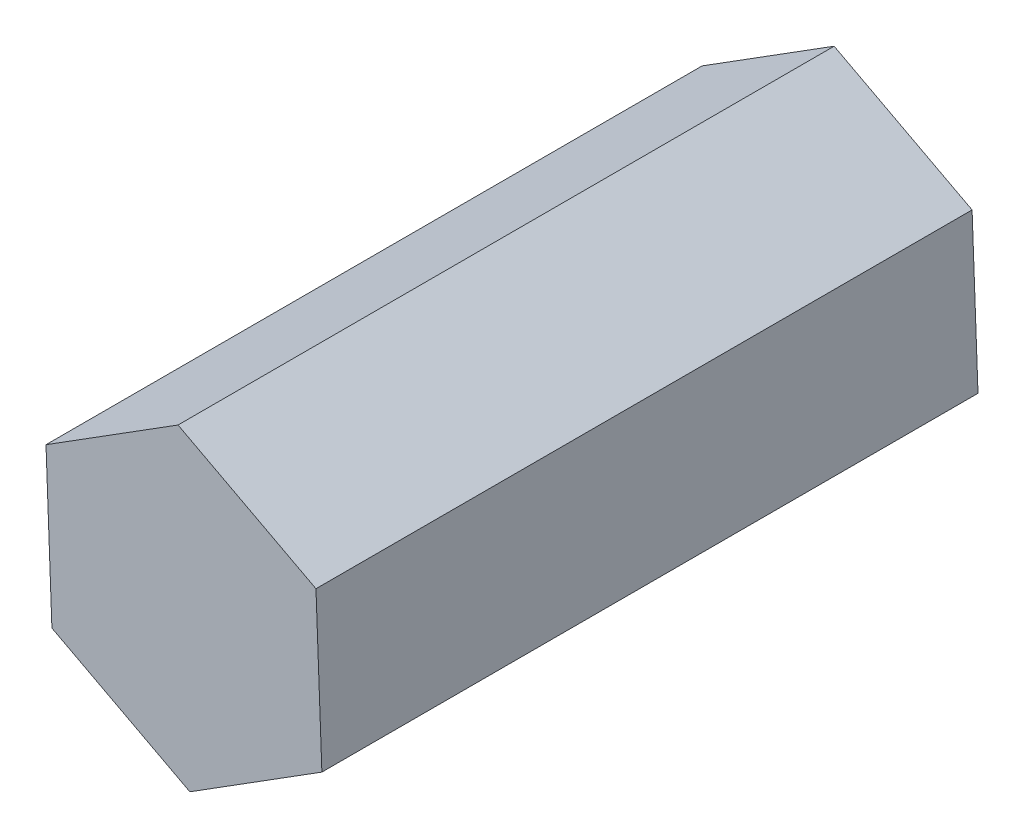
ISO-10303-21;
HEADER;
FILE_DESCRIPTION(('STEP AP214'),'2;1');
FILE_NAME('part.step','',(''),(''),'','','');
FILE_SCHEMA(('AUTOMOTIVE_DESIGN { 1 0 10303 214 1 1 1 1 }'));
ENDSEC;
DATA;
#1=APPLICATION_CONTEXT('core data for automotive mechanical design processes');
#2=APPLICATION_PROTOCOL_DEFINITION('international standard','automotive_design',2000,#1);
#3=PRODUCT_CONTEXT('',#1,'mechanical');
#4=PRODUCT('Part','Part','',(#3));
#5=PRODUCT_RELATED_PRODUCT_CATEGORY('part','',(#4));
#6=PRODUCT_DEFINITION_FORMATION('','',#4);
#7=PRODUCT_DEFINITION_CONTEXT('part definition',#1,'design');
#8=PRODUCT_DEFINITION('design','',#6,#7);
#9=PRODUCT_DEFINITION_SHAPE('','',#8);
#10=(LENGTH_UNIT() NAMED_UNIT(*) SI_UNIT(.MILLI.,.METRE.));
#11=(NAMED_UNIT(*) PLANE_ANGLE_UNIT() SI_UNIT($,.RADIAN.));
#12=(NAMED_UNIT(*) SI_UNIT($,.STERADIAN.) SOLID_ANGLE_UNIT());
#13=UNCERTAINTY_MEASURE_WITH_UNIT(LENGTH_MEASURE(1.E-05),#10,'distance_accuracy_value','');
#14=(GEOMETRIC_REPRESENTATION_CONTEXT(3) GLOBAL_UNCERTAINTY_ASSIGNED_CONTEXT((#13)) GLOBAL_UNIT_ASSIGNED_CONTEXT((#10,
#11,#12)) REPRESENTATION_CONTEXT('',''));
#15=CARTESIAN_POINT('',(0.,0.,0.));
#16=DIRECTION('',(0.,0.,1.));
#17=DIRECTION('',(1.,0.,0.));
#18=AXIS2_PLACEMENT_3D('',#15,#16,#17);
#19=CARTESIAN_POINT('',(0.,0.,0.));
#20=DIRECTION('',(0.,0.,1.));
#21=DIRECTION('',(1.,0.,0.));
#22=AXIS2_PLACEMENT_3D('',#19,#20,#21);
#23=PLANE('',#22);
#24=DIRECTION('',(0.846417198396171,0.532520352906044,0.));
#25=VECTOR('',#24,1.);
#26=CARTESIAN_POINT('',(0.153444044478499,-4.038537886234,0.));
#27=LINE('',#26,#25);
#28=CARTESIAN_POINT('',(0.153444044478499,-4.038537886234,0.));
#29=VERTEX_POINT('',#28);
#30=CARTESIAN_POINT('',(3.5741984258638,-1.88638250253919,0.));
#31=VERTEX_POINT('',#30);
#32=EDGE_CURVE('E131',#29,#31,#27,.T.);
#33=ORIENTED_EDGE('',*,*,#32,.F.);
#34=DIRECTION('',(0.884384752846973,-0.466758619558115,0.));
#35=VECTOR('',#34,1.);
#36=CARTESIAN_POINT('',(-3.42075438138531,-2.15215538369481,0.));
#37=LINE('',#36,#35);
#38=CARTESIAN_POINT('',(-3.42075438138531,-2.15215538369481,0.));
#39=VERTEX_POINT('',#38);
#40=EDGE_CURVE('E85',#39,#29,#37,.T.);
#41=ORIENTED_EDGE('',*,*,#40,.F.);
#42=DIRECTION('',(0.0379675544508028,-0.999278972464159,0.));
#43=VECTOR('',#42,1.);
#44=CARTESIAN_POINT('',(-3.57419842586381,1.88638250253919,0.));
#45=LINE('',#44,#43);
#46=CARTESIAN_POINT('',(-3.57419842586381,1.88638250253919,0.));
#47=VERTEX_POINT('',#46);
#48=EDGE_CURVE('E140',#47,#39,#45,.T.);
#49=ORIENTED_EDGE('',*,*,#48,.F.);
#50=DIRECTION('',(-0.846417198396171,-0.532520352906044,0.));
#51=VECTOR('',#50,1.);
#52=CARTESIAN_POINT('',(-0.1534440444785,4.038537886234,0.));
#53=LINE('',#52,#51);
#54=CARTESIAN_POINT('',(-0.1534440444785,4.038537886234,0.));
#55=VERTEX_POINT('',#54);
#56=EDGE_CURVE('E119',#55,#47,#53,.T.);
#57=ORIENTED_EDGE('',*,*,#56,.F.);
#58=DIRECTION('',(-0.884384752846974,0.466758619558115,0.));
#59=VECTOR('',#58,1.);
#60=CARTESIAN_POINT('',(3.4207543813853,2.15215538369481,0.));
#61=LINE('',#60,#59);
#62=CARTESIAN_POINT('',(3.4207543813853,2.15215538369481,0.));
#63=VERTEX_POINT('',#62);
#64=EDGE_CURVE('E137',#63,#55,#61,.T.);
#65=ORIENTED_EDGE('',*,*,#64,.F.);
#66=DIRECTION('',(-0.0379675544508031,0.999278972464159,0.));
#67=VECTOR('',#66,1.);
#68=CARTESIAN_POINT('',(3.5741984258638,-1.88638250253919,0.));
#69=LINE('',#68,#67);
#70=EDGE_CURVE('E134',#31,#63,#69,.T.);
#71=ORIENTED_EDGE('',*,*,#70,.F.);
#72=EDGE_LOOP('',(#33,#41,#49,#57,#65,#71));
#73=FACE_BOUND('',#72,.T.);
#74=CARTESIAN_POINT('',(0.,0.,0.));
#75=DIRECTION('',(0.,0.,1.));
#76=DIRECTION('',(1.,0.,0.));
#77=AXIS2_PLACEMENT_3D('',#74,#75,#76);
#78=CIRCLE('',#77,1.5);
#79=CARTESIAN_POINT('',(0.760034389601691,1.2931928420088,0.));
#80=VERTEX_POINT('',#79);
#81=CARTESIAN_POINT('',(1.19535695179051,-0.906157689260598,0.));
#82=VERTEX_POINT('',#81);
#83=EDGE_CURVE('E49',#80,#82,#78,.T.);
#84=ORIENTED_EDGE('',*,*,#83,.T.);
#85=DIRECTION('',(-0.194165434220254,0.980968798766842,0.));
#86=VECTOR('',#85,1.);
#87=CARTESIAN_POINT('',(0.760034389601691,1.2931928420088,0.));
#88=LINE('',#87,#86);
#89=EDGE_CURVE('E164',#82,#80,#88,.T.);
#90=ORIENTED_EDGE('',*,*,#89,.T.);
#91=EDGE_LOOP('',(#84,#90));
#92=FACE_BOUND('',#91,.T.);
#93=ADVANCED_FACE('F34',(#73,#92),#23,.F.);
#94=CARTESIAN_POINT('',(0.153444044478499,-4.038537886234,17.));
#95=DIRECTION('',(-0.532520352906044,0.846417198396171,0.));
#96=DIRECTION('',(-0.846417198396171,-0.532520352906044,0.));
#97=AXIS2_PLACEMENT_3D('',#94,#95,#96);
#98=PLANE('',#97);
#99=ORIENTED_EDGE('',*,*,#32,.T.);
#100=DIRECTION('',(0.,0.,-1.));
#101=VECTOR('',#100,1.);
#102=CARTESIAN_POINT('',(3.5741984258638,-1.88638250253919,17.));
#103=LINE('',#102,#101);
#104=CARTESIAN_POINT('',(3.5741984258638,-1.88638250253919,17.));
#105=VERTEX_POINT('',#104);
#106=EDGE_CURVE('E11',#105,#31,#103,.T.);
#107=ORIENTED_EDGE('',*,*,#106,.F.);
#108=DIRECTION('',(0.846417198396171,0.532520352906044,0.));
#109=VECTOR('',#108,1.);
#110=CARTESIAN_POINT('',(0.153444044478499,-4.038537886234,17.));
#111=LINE('',#110,#109);
#112=CARTESIAN_POINT('',(0.153444044478499,-4.038537886234,17.));
#113=VERTEX_POINT('',#112);
#114=EDGE_CURVE('E143',#113,#105,#111,.T.);
#115=ORIENTED_EDGE('',*,*,#114,.F.);
#116=DIRECTION('',(0.,0.,-1.));
#117=VECTOR('',#116,1.);
#118=CARTESIAN_POINT('',(0.153444044478499,-4.038537886234,17.));
#119=LINE('',#118,#117);
#120=EDGE_CURVE('E127',#113,#29,#119,.T.);
#121=ORIENTED_EDGE('',*,*,#120,.T.);
#122=EDGE_LOOP('',(#99,#107,#115,#121));
#123=FACE_BOUND('',#122,.T.);
#124=ADVANCED_FACE('F36',(#123),#98,.F.);
#125=CARTESIAN_POINT('',(3.5741984258638,-1.88638250253919,17.));
#126=DIRECTION('',(-0.999278972464159,-0.0379675544508031,0.));
#127=DIRECTION('',(0.0379675544508031,-0.999278972464159,0.));
#128=AXIS2_PLACEMENT_3D('',#125,#126,#127);
#129=PLANE('',#128);
#130=ORIENTED_EDGE('',*,*,#70,.T.);
#131=DIRECTION('',(0.,0.,-1.));
#132=VECTOR('',#131,1.);
#133=CARTESIAN_POINT('',(3.4207543813853,2.15215538369481,17.));
#134=LINE('',#133,#132);
#135=CARTESIAN_POINT('',(3.4207543813853,2.15215538369481,17.));
#136=VERTEX_POINT('',#135);
#137=EDGE_CURVE('E42',#136,#63,#134,.T.);
#138=ORIENTED_EDGE('',*,*,#137,.F.);
#139=DIRECTION('',(-0.0379675544508031,0.999278972464159,0.));
#140=VECTOR('',#139,1.);
#141=CARTESIAN_POINT('',(3.5741984258638,-1.88638250253919,17.));
#142=LINE('',#141,#140);
#143=EDGE_CURVE('E93',#105,#136,#142,.T.);
#144=ORIENTED_EDGE('',*,*,#143,.F.);
#145=ORIENTED_EDGE('',*,*,#106,.T.);
#146=EDGE_LOOP('',(#130,#138,#144,#145));
#147=FACE_BOUND('',#146,.T.);
#148=ADVANCED_FACE('F187',(#147),#129,.F.);
#149=CARTESIAN_POINT('',(3.4207543813853,2.15215538369481,17.));
#150=DIRECTION('',(-0.466758619558115,-0.884384752846974,0.));
#151=DIRECTION('',(0.884384752846974,-0.466758619558115,0.));
#152=AXIS2_PLACEMENT_3D('',#149,#150,#151);
#153=PLANE('',#152);
#154=ORIENTED_EDGE('',*,*,#64,.T.);
#155=DIRECTION('',(0.,0.,-1.));
#156=VECTOR('',#155,1.);
#157=CARTESIAN_POINT('',(-0.1534440444785,4.038537886234,17.));
#158=LINE('',#157,#156);
#159=CARTESIAN_POINT('',(-0.1534440444785,4.038537886234,17.));
#160=VERTEX_POINT('',#159);
#161=EDGE_CURVE('E122',#160,#55,#158,.T.);
#162=ORIENTED_EDGE('',*,*,#161,.F.);
#163=DIRECTION('',(-0.884384752846974,0.466758619558115,0.));
#164=VECTOR('',#163,1.);
#165=CARTESIAN_POINT('',(3.4207543813853,2.15215538369481,17.));
#166=LINE('',#165,#164);
#167=EDGE_CURVE('E110',#136,#160,#166,.T.);
#168=ORIENTED_EDGE('',*,*,#167,.F.);
#169=ORIENTED_EDGE('',*,*,#137,.T.);
#170=EDGE_LOOP('',(#154,#162,#168,#169));
#171=FACE_BOUND('',#170,.T.);
#172=ADVANCED_FACE('F149',(#171),#153,.F.);
#173=CARTESIAN_POINT('',(-0.1534440444785,4.038537886234,17.));
#174=DIRECTION('',(0.532520352906044,-0.846417198396171,0.));
#175=DIRECTION('',(0.846417198396171,0.532520352906044,0.));
#176=AXIS2_PLACEMENT_3D('',#173,#174,#175);
#177=PLANE('',#176);
#178=ORIENTED_EDGE('',*,*,#56,.T.);
#179=DIRECTION('',(0.,0.,-1.));
#180=VECTOR('',#179,1.);
#181=CARTESIAN_POINT('',(-3.57419842586381,1.88638250253919,17.));
#182=LINE('',#181,#180);
#183=CARTESIAN_POINT('',(-3.57419842586381,1.88638250253919,17.));
#184=VERTEX_POINT('',#183);
#185=EDGE_CURVE('E116',#184,#47,#182,.T.);
#186=ORIENTED_EDGE('',*,*,#185,.F.);
#187=DIRECTION('',(-0.846417198396171,-0.532520352906044,0.));
#188=VECTOR('',#187,1.);
#189=CARTESIAN_POINT('',(-0.1534440444785,4.038537886234,17.));
#190=LINE('',#189,#188);
#191=EDGE_CURVE('E103',#160,#184,#190,.T.);
#192=ORIENTED_EDGE('',*,*,#191,.F.);
#193=ORIENTED_EDGE('',*,*,#161,.T.);
#194=EDGE_LOOP('',(#178,#186,#192,#193));
#195=FACE_BOUND('',#194,.T.);
#196=ADVANCED_FACE('F117',(#195),#177,.F.);
#197=CARTESIAN_POINT('',(-3.57419842586381,1.88638250253919,17.));
#198=DIRECTION('',(0.999278972464159,0.0379675544508028,0.));
#199=DIRECTION('',(-0.0379675544508028,0.999278972464159,0.));
#200=AXIS2_PLACEMENT_3D('',#197,#198,#199);
#201=PLANE('',#200);
#202=ORIENTED_EDGE('',*,*,#48,.T.);
#203=DIRECTION('',(0.,0.,-1.));
#204=VECTOR('',#203,1.);
#205=CARTESIAN_POINT('',(-3.42075438138531,-2.15215538369481,17.));
#206=LINE('',#205,#204);
#207=CARTESIAN_POINT('',(-3.42075438138531,-2.15215538369481,17.));
#208=VERTEX_POINT('',#207);
#209=EDGE_CURVE('E123',#208,#39,#206,.T.);
#210=ORIENTED_EDGE('',*,*,#209,.F.);
#211=DIRECTION('',(0.0379675544508028,-0.999278972464159,0.));
#212=VECTOR('',#211,1.);
#213=CARTESIAN_POINT('',(-3.57419842586381,1.88638250253919,17.));
#214=LINE('',#213,#212);
#215=EDGE_CURVE('E107',#184,#208,#214,.T.);
#216=ORIENTED_EDGE('',*,*,#215,.F.);
#217=ORIENTED_EDGE('',*,*,#185,.T.);
#218=EDGE_LOOP('',(#202,#210,#216,#217));
#219=FACE_BOUND('',#218,.T.);
#220=ADVANCED_FACE('F125',(#219),#201,.F.);
#221=CARTESIAN_POINT('',(-3.42075438138531,-2.15215538369481,17.));
#222=DIRECTION('',(0.466758619558115,0.884384752846974,0.));
#223=DIRECTION('',(-0.884384752846974,0.466758619558115,0.));
#224=AXIS2_PLACEMENT_3D('',#221,#222,#223);
#225=PLANE('',#224);
#226=ORIENTED_EDGE('',*,*,#40,.T.);
#227=ORIENTED_EDGE('',*,*,#120,.F.);
#228=DIRECTION('',(0.884384752846973,-0.466758619558115,0.));
#229=VECTOR('',#228,1.);
#230=CARTESIAN_POINT('',(-3.42075438138531,-2.15215538369481,17.));
#231=LINE('',#230,#229);
#232=EDGE_CURVE('E58',#208,#113,#231,.T.);
#233=ORIENTED_EDGE('',*,*,#232,.F.);
#234=ORIENTED_EDGE('',*,*,#209,.T.);
#235=EDGE_LOOP('',(#226,#227,#233,#234));
#236=FACE_BOUND('',#235,.T.);
#237=ADVANCED_FACE('F153',(#236),#225,.F.);
#238=CARTESIAN_POINT('',(0.,0.,17.));
#239=DIRECTION('',(0.,0.,1.));
#240=DIRECTION('',(1.,0.,0.));
#241=AXIS2_PLACEMENT_3D('',#238,#239,#240);
#242=PLANE('',#241);
#243=ORIENTED_EDGE('',*,*,#114,.T.);
#244=ORIENTED_EDGE('',*,*,#143,.T.);
#245=ORIENTED_EDGE('',*,*,#167,.T.);
#246=ORIENTED_EDGE('',*,*,#191,.T.);
#247=ORIENTED_EDGE('',*,*,#215,.T.);
#248=ORIENTED_EDGE('',*,*,#232,.T.);
#249=EDGE_LOOP('',(#243,#244,#245,#246,#247,#248));
#250=FACE_BOUND('',#249,.T.);
#251=ADVANCED_FACE('F105',(#250),#242,.T.);
#252=CARTESIAN_POINT('',(0.,0.,8.));
#253=DIRECTION('',(0.,0.,-1.));
#254=DIRECTION('',(-1.,0.,0.));
#255=AXIS2_PLACEMENT_3D('',#252,#253,#254);
#256=CYLINDRICAL_SURFACE('',#255,1.5);
#257=ORIENTED_EDGE('',*,*,#83,.F.);
#258=DIRECTION('',(0.,0.,-1.));
#259=VECTOR('',#258,1.);
#260=CARTESIAN_POINT('',(0.760034389601691,1.2931928420088,8.));
#261=LINE('',#260,#259);
#262=CARTESIAN_POINT('',(0.760034389601691,1.2931928420088,8.));
#263=VERTEX_POINT('',#262);
#264=EDGE_CURVE('E161',#263,#80,#261,.T.);
#265=ORIENTED_EDGE('',*,*,#264,.F.);
#266=CARTESIAN_POINT('',(0.,0.,8.));
#267=DIRECTION('',(0.,0.,1.));
#268=DIRECTION('',(1.,0.,0.));
#269=AXIS2_PLACEMENT_3D('',#266,#267,#268);
#270=CIRCLE('',#269,1.5);
#271=CARTESIAN_POINT('',(1.19535695179051,-0.906157689260598,8.));
#272=VERTEX_POINT('',#271);
#273=EDGE_CURVE('E167',#263,#272,#270,.T.);
#274=ORIENTED_EDGE('',*,*,#273,.T.);
#275=DIRECTION('',(0.,0.,-1.));
#276=VECTOR('',#275,1.);
#277=CARTESIAN_POINT('',(1.19535695179051,-0.906157689260598,8.));
#278=LINE('',#277,#276);
#279=EDGE_CURVE('E135',#272,#82,#278,.T.);
#280=ORIENTED_EDGE('',*,*,#279,.T.);
#281=EDGE_LOOP('',(#257,#265,#274,#280));
#282=FACE_BOUND('',#281,.T.);
#283=ADVANCED_FACE('F175',(#282),#256,.F.);
#284=CARTESIAN_POINT('',(0.760034389601691,1.2931928420088,8.));
#285=DIRECTION('',(-0.980968798766842,-0.194165434220254,0.));
#286=DIRECTION('',(0.194165434220254,-0.980968798766842,0.));
#287=AXIS2_PLACEMENT_3D('',#284,#285,#286);
#288=PLANE('',#287);
#289=ORIENTED_EDGE('',*,*,#89,.F.);
#290=ORIENTED_EDGE('',*,*,#279,.F.);
#291=DIRECTION('',(-0.194165434220254,0.980968798766842,0.));
#292=VECTOR('',#291,1.);
#293=CARTESIAN_POINT('',(0.760034389601691,1.2931928420088,8.));
#294=LINE('',#293,#292);
#295=EDGE_CURVE('E163',#272,#263,#294,.T.);
#296=ORIENTED_EDGE('',*,*,#295,.T.);
#297=ORIENTED_EDGE('',*,*,#264,.T.);
#298=EDGE_LOOP('',(#289,#290,#296,#297));
#299=FACE_BOUND('',#298,.T.);
#300=ADVANCED_FACE('F181',(#299),#288,.T.);
#301=CARTESIAN_POINT('',(0.,0.,8.));
#302=DIRECTION('',(0.,0.,1.));
#303=DIRECTION('',(1.,0.,0.));
#304=AXIS2_PLACEMENT_3D('',#301,#302,#303);
#305=PLANE('',#304);
#306=ORIENTED_EDGE('',*,*,#273,.F.);
#307=ORIENTED_EDGE('',*,*,#295,.F.);
#308=EDGE_LOOP('',(#306,#307));
#309=FACE_BOUND('',#308,.T.);
#310=ADVANCED_FACE('F235',(#309),#305,.F.);
#311=CLOSED_SHELL('',(#93,#124,#148,#172,#196,#220,#237,#251,#283,#300,#310));
#312=MANIFOLD_SOLID_BREP('B2',#311);
#313=ADVANCED_BREP_SHAPE_REPRESENTATION('',(#18,#312),#14);
#314=SHAPE_DEFINITION_REPRESENTATION(#9,#313);
ENDSEC;
END-ISO-10303-21;
